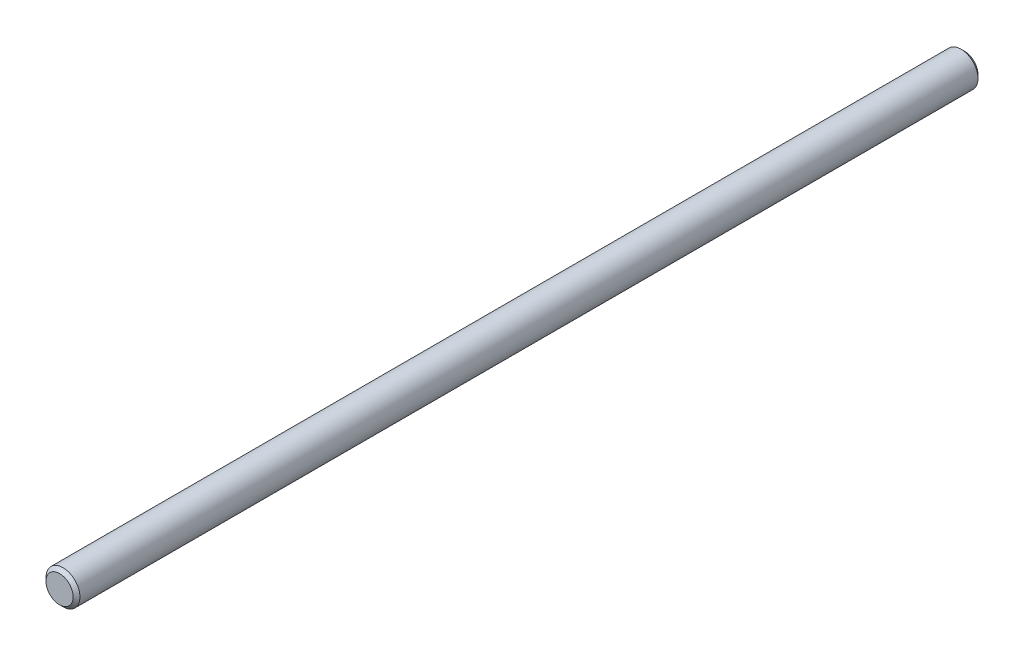
ISO-10303-21;
HEADER;
FILE_DESCRIPTION(('STEP AP214'),'2;1');
FILE_NAME('part.step','',(''),(''),'','','');
FILE_SCHEMA(('AUTOMOTIVE_DESIGN { 1 0 10303 214 1 1 1 1 }'));
ENDSEC;
DATA;
#1=APPLICATION_CONTEXT('core data for automotive mechanical design processes');
#2=APPLICATION_PROTOCOL_DEFINITION('international standard','automotive_design',2000,#1);
#3=PRODUCT_CONTEXT('',#1,'mechanical');
#4=PRODUCT('Part','Part','',(#3));
#5=PRODUCT_RELATED_PRODUCT_CATEGORY('part','',(#4));
#6=PRODUCT_DEFINITION_FORMATION('','',#4);
#7=PRODUCT_DEFINITION_CONTEXT('part definition',#1,'design');
#8=PRODUCT_DEFINITION('design','',#6,#7);
#9=PRODUCT_DEFINITION_SHAPE('','',#8);
#10=(LENGTH_UNIT() NAMED_UNIT(*) SI_UNIT(.MILLI.,.METRE.));
#11=(NAMED_UNIT(*) PLANE_ANGLE_UNIT() SI_UNIT($,.RADIAN.));
#12=(NAMED_UNIT(*) SI_UNIT($,.STERADIAN.) SOLID_ANGLE_UNIT());
#13=UNCERTAINTY_MEASURE_WITH_UNIT(LENGTH_MEASURE(1.E-05),#10,'distance_accuracy_value','');
#14=(GEOMETRIC_REPRESENTATION_CONTEXT(3) GLOBAL_UNCERTAINTY_ASSIGNED_CONTEXT((#13)) GLOBAL_UNIT_ASSIGNED_CONTEXT((#10,
#11,#12)) REPRESENTATION_CONTEXT('',''));
#15=CARTESIAN_POINT('',(0.,0.,0.));
#16=DIRECTION('',(0.,0.,1.));
#17=DIRECTION('',(1.,0.,0.));
#18=AXIS2_PLACEMENT_3D('',#15,#16,#17);
#19=CARTESIAN_POINT('',(0.,0.,127.));
#20=DIRECTION('',(0.,0.,-1.));
#21=DIRECTION('',(-1.,0.,0.));
#22=AXIS2_PLACEMENT_3D('',#19,#20,#21);
#23=CYLINDRICAL_SURFACE('',#22,4.7625);
#24=CARTESIAN_POINT('',(0.,0.,-126.0475));
#25=DIRECTION('',(0.,0.,1.));
#26=DIRECTION('',(1.,0.,0.));
#27=AXIS2_PLACEMENT_3D('',#24,#25,#26);
#28=CIRCLE('',#27,4.7625);
#29=CARTESIAN_POINT('',(4.7625,0.,-126.0475));
#30=VERTEX_POINT('',#29);
#31=EDGE_CURVE('E43',#30,#30,#28,.T.);
#32=ORIENTED_EDGE('',*,*,#31,.T.);
#33=EDGE_LOOP('',(#32));
#34=FACE_BOUND('',#33,.T.);
#35=CARTESIAN_POINT('',(0.,0.,126.0475));
#36=DIRECTION('',(0.,0.,1.));
#37=DIRECTION('',(1.,0.,0.));
#38=AXIS2_PLACEMENT_3D('',#35,#36,#37);
#39=CIRCLE('',#38,4.7625);
#40=CARTESIAN_POINT('',(4.7625,0.,126.0475));
#41=VERTEX_POINT('',#40);
#42=EDGE_CURVE('E47',#41,#41,#39,.F.);
#43=ORIENTED_EDGE('',*,*,#42,.T.);
#44=EDGE_LOOP('',(#43));
#45=FACE_BOUND('',#44,.T.);
#46=ADVANCED_FACE('F32',(#34,#45),#23,.T.);
#47=CARTESIAN_POINT('',(0.,0.,127.));
#48=DIRECTION('',(0.,0.,1.));
#49=DIRECTION('',(1.,0.,0.));
#50=AXIS2_PLACEMENT_3D('',#47,#48,#49);
#51=PLANE('',#50);
#52=CARTESIAN_POINT('',(0.,0.,127.));
#53=DIRECTION('',(0.,0.,1.));
#54=DIRECTION('',(1.,0.,0.));
#55=AXIS2_PLACEMENT_3D('',#52,#53,#54);
#56=CIRCLE('',#55,3.81000000000006);
#57=CARTESIAN_POINT('',(3.81000000000006,0.,127.));
#58=VERTEX_POINT('',#57);
#59=EDGE_CURVE('E10',#58,#58,#56,.T.);
#60=ORIENTED_EDGE('',*,*,#59,.T.);
#61=EDGE_LOOP('',(#60));
#62=FACE_BOUND('',#61,.T.);
#63=ADVANCED_FACE('F63',(#62),#51,.T.);
#64=CARTESIAN_POINT('',(0.,0.,-127.));
#65=DIRECTION('',(0.,0.,1.));
#66=DIRECTION('',(1.,0.,0.));
#67=AXIS2_PLACEMENT_3D('',#64,#65,#66);
#68=PLANE('',#67);
#69=CARTESIAN_POINT('',(0.,0.,-127.));
#70=DIRECTION('',(0.,0.,1.));
#71=DIRECTION('',(1.,0.,0.));
#72=AXIS2_PLACEMENT_3D('',#69,#70,#71);
#73=CIRCLE('',#72,3.81000000000001);
#74=CARTESIAN_POINT('',(3.81000000000001,0.,-127.));
#75=VERTEX_POINT('',#74);
#76=EDGE_CURVE('E39',#75,#75,#73,.F.);
#77=ORIENTED_EDGE('',*,*,#76,.T.);
#78=EDGE_LOOP('',(#77));
#79=FACE_BOUND('',#78,.T.);
#80=ADVANCED_FACE('F60',(#79),#68,.F.);
#81=CARTESIAN_POINT('',(0.,0.,-126.0475));
#82=DIRECTION('',(0.,0.,1.));
#83=DIRECTION('',(1.,0.,0.));
#84=AXIS2_PLACEMENT_3D('',#81,#82,#83);
#85=CONICAL_SURFACE('',#84,4.7625,0.785398163397432);
#86=ORIENTED_EDGE('',*,*,#76,.F.);
#87=EDGE_LOOP('',(#86));
#88=FACE_BOUND('',#87,.T.);
#89=ORIENTED_EDGE('',*,*,#31,.F.);
#90=EDGE_LOOP('',(#89));
#91=FACE_BOUND('',#90,.T.);
#92=ADVANCED_FACE('F56',(#88,#91),#85,.T.);
#93=CARTESIAN_POINT('',(0.,0.,127.));
#94=DIRECTION('',(0.,0.,-1.));
#95=DIRECTION('',(-1.,0.,0.));
#96=AXIS2_PLACEMENT_3D('',#93,#94,#95);
#97=CONICAL_SURFACE('',#96,3.81000000000006,0.785398163397447);
#98=ORIENTED_EDGE('',*,*,#42,.F.);
#99=EDGE_LOOP('',(#98));
#100=FACE_BOUND('',#99,.T.);
#101=ORIENTED_EDGE('',*,*,#59,.F.);
#102=EDGE_LOOP('',(#101));
#103=FACE_BOUND('',#102,.T.);
#104=ADVANCED_FACE('F34',(#100,#103),#97,.T.);
#105=CLOSED_SHELL('',(#46,#63,#80,#92,#104));
#106=MANIFOLD_SOLID_BREP('B2',#105);
#107=ADVANCED_BREP_SHAPE_REPRESENTATION('',(#18,#106),#14);
#108=SHAPE_DEFINITION_REPRESENTATION(#9,#107);
ENDSEC;
END-ISO-10303-21;
